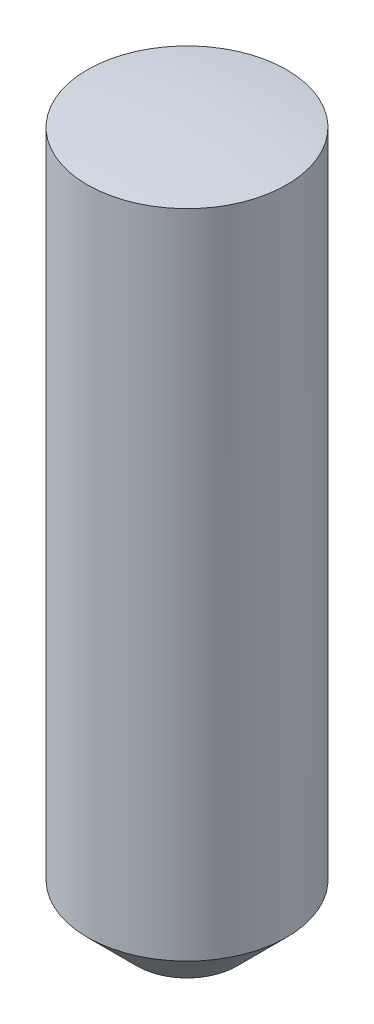
ISO-10303-21;
HEADER;
FILE_DESCRIPTION(('STEP AP214'),'2;1');
FILE_NAME('part.step','',(''),(''),'','','');
FILE_SCHEMA(('AUTOMOTIVE_DESIGN { 1 0 10303 214 1 1 1 1 }'));
ENDSEC;
DATA;
#1=APPLICATION_CONTEXT('core data for automotive mechanical design processes');
#2=APPLICATION_PROTOCOL_DEFINITION('international standard','automotive_design',2000,#1);
#3=PRODUCT_CONTEXT('',#1,'mechanical');
#4=PRODUCT('Part','Part','',(#3));
#5=PRODUCT_RELATED_PRODUCT_CATEGORY('part','',(#4));
#6=PRODUCT_DEFINITION_FORMATION('','',#4);
#7=PRODUCT_DEFINITION_CONTEXT('part definition',#1,'design');
#8=PRODUCT_DEFINITION('design','',#6,#7);
#9=PRODUCT_DEFINITION_SHAPE('','',#8);
#10=(LENGTH_UNIT() NAMED_UNIT(*) SI_UNIT(.MILLI.,.METRE.));
#11=(NAMED_UNIT(*) PLANE_ANGLE_UNIT() SI_UNIT($,.RADIAN.));
#12=(NAMED_UNIT(*) SI_UNIT($,.STERADIAN.) SOLID_ANGLE_UNIT());
#13=UNCERTAINTY_MEASURE_WITH_UNIT(LENGTH_MEASURE(1.E-05),#10,'distance_accuracy_value','');
#14=(GEOMETRIC_REPRESENTATION_CONTEXT(3) GLOBAL_UNCERTAINTY_ASSIGNED_CONTEXT((#13)) GLOBAL_UNIT_ASSIGNED_CONTEXT((#10,
#11,#12)) REPRESENTATION_CONTEXT('',''));
#15=CARTESIAN_POINT('',(0.,0.,0.));
#16=DIRECTION('',(0.,0.,1.));
#17=DIRECTION('',(1.,0.,0.));
#18=AXIS2_PLACEMENT_3D('',#15,#16,#17);
#19=CARTESIAN_POINT('',(0.,-7.1,0.));
#20=DIRECTION('',(0.,1.,0.));
#21=DIRECTION('',(0.,0.,1.));
#22=AXIS2_PLACEMENT_3D('',#19,#20,#21);
#23=CYLINDRICAL_SURFACE('',#22,1.);
#24=CARTESIAN_POINT('',(0.,-6.6,0.));
#25=DIRECTION('',(0.,1.,0.));
#26=DIRECTION('',(0.,0.,1.));
#27=AXIS2_PLACEMENT_3D('',#24,#25,#26);
#28=CIRCLE('',#27,1.);
#29=CARTESIAN_POINT('',(0.,-6.6,1.));
#30=VERTEX_POINT('',#29);
#31=EDGE_CURVE('E41',#30,#30,#28,.T.);
#32=ORIENTED_EDGE('',*,*,#31,.T.);
#33=EDGE_LOOP('',(#32));
#34=FACE_BOUND('',#33,.T.);
#35=CARTESIAN_POINT('',(0.,-0.0627460668062279,0.));
#36=DIRECTION('',(0.,-1.,0.));
#37=DIRECTION('',(0.,0.,-1.));
#38=AXIS2_PLACEMENT_3D('',#35,#36,#37);
#39=CIRCLE('',#38,1.);
#40=CARTESIAN_POINT('',(0.,-0.0627460668062279,-1.));
#41=VERTEX_POINT('',#40);
#42=EDGE_CURVE('E37',#41,#41,#39,.T.);
#43=ORIENTED_EDGE('',*,*,#42,.T.);
#44=EDGE_LOOP('',(#43));
#45=FACE_BOUND('',#44,.T.);
#46=ADVANCED_FACE('F33',(#34,#45),#23,.T.);
#47=CARTESIAN_POINT('',(0.,-7.1,0.));
#48=DIRECTION('',(0.,1.,0.));
#49=DIRECTION('',(0.,0.,1.));
#50=AXIS2_PLACEMENT_3D('',#47,#48,#49);
#51=PLANE('',#50);
#52=CARTESIAN_POINT('',(0.,-7.1,0.));
#53=DIRECTION('',(0.,1.,0.));
#54=DIRECTION('',(0.,0.,1.));
#55=AXIS2_PLACEMENT_3D('',#52,#53,#54);
#56=CIRCLE('',#55,0.499999999999996);
#57=CARTESIAN_POINT('',(0.,-7.1,0.499999999999996));
#58=VERTEX_POINT('',#57);
#59=EDGE_CURVE('E11',#58,#58,#56,.F.);
#60=ORIENTED_EDGE('',*,*,#59,.T.);
#61=EDGE_LOOP('',(#60));
#62=FACE_BOUND('',#61,.T.);
#63=ADVANCED_FACE('F57',(#62),#51,.F.);
#64=CARTESIAN_POINT('',(0.,-6.6,0.));
#65=DIRECTION('',(0.,1.,0.));
#66=DIRECTION('',(0.,0.,1.));
#67=AXIS2_PLACEMENT_3D('',#64,#65,#66);
#68=CONICAL_SURFACE('',#67,1.,0.78539816339745);
#69=ORIENTED_EDGE('',*,*,#59,.F.);
#70=EDGE_LOOP('',(#69));
#71=FACE_BOUND('',#70,.T.);
#72=ORIENTED_EDGE('',*,*,#31,.F.);
#73=EDGE_LOOP('',(#72));
#74=FACE_BOUND('',#73,.T.);
#75=ADVANCED_FACE('F35',(#71,#74),#68,.T.);
#76=CARTESIAN_POINT('',(0.,-8.,0.));
#77=DIRECTION('',(0.,-1.,0.));
#78=DIRECTION('',(-1.,0.,0.));
#79=AXIS2_PLACEMENT_3D('',#76,#77,#78);
#80=SPHERICAL_SURFACE('',#79,8.);
#81=CARTESIAN_POINT('',(0.,0.,0.));
#82=VERTEX_POINT('',#81);
#83=VERTEX_LOOP('',#82);
#84=FACE_BOUND('',#83,.T.);
#85=ORIENTED_EDGE('',*,*,#42,.F.);
#86=EDGE_LOOP('',(#85));
#87=FACE_BOUND('',#86,.T.);
#88=ADVANCED_FACE('F44',(#84,#87),#80,.T.);
#89=CLOSED_SHELL('',(#46,#63,#75,#88));
#90=MANIFOLD_SOLID_BREP('B2',#89);
#91=ADVANCED_BREP_SHAPE_REPRESENTATION('',(#18,#90),#14);
#92=SHAPE_DEFINITION_REPRESENTATION(#9,#91);
ENDSEC;
END-ISO-10303-21;
